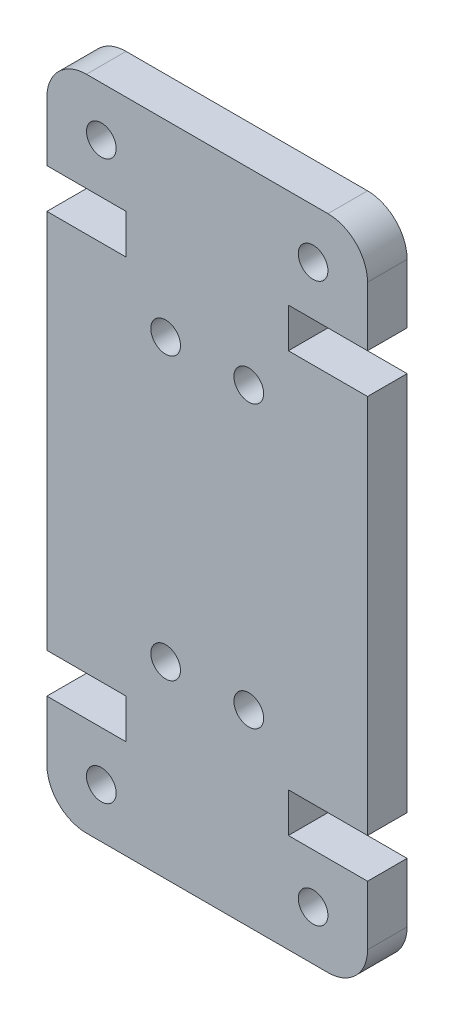
ISO-10303-21;
HEADER;
FILE_DESCRIPTION(('STEP AP214'),'2;1');
FILE_NAME('part.step','',(''),(''),'','','');
FILE_SCHEMA(('AUTOMOTIVE_DESIGN { 1 0 10303 214 1 1 1 1 }'));
ENDSEC;
DATA;
#1=APPLICATION_CONTEXT('core data for automotive mechanical design processes');
#2=APPLICATION_PROTOCOL_DEFINITION('international standard','automotive_design',2000,#1);
#3=PRODUCT_CONTEXT('',#1,'mechanical');
#4=PRODUCT('Part','Part','',(#3));
#5=PRODUCT_RELATED_PRODUCT_CATEGORY('part','',(#4));
#6=PRODUCT_DEFINITION_FORMATION('','',#4);
#7=PRODUCT_DEFINITION_CONTEXT('part definition',#1,'design');
#8=PRODUCT_DEFINITION('design','',#6,#7);
#9=PRODUCT_DEFINITION_SHAPE('','',#8);
#10=(LENGTH_UNIT() NAMED_UNIT(*) SI_UNIT(.MILLI.,.METRE.));
#11=(NAMED_UNIT(*) PLANE_ANGLE_UNIT() SI_UNIT($,.RADIAN.));
#12=(NAMED_UNIT(*) SI_UNIT($,.STERADIAN.) SOLID_ANGLE_UNIT());
#13=UNCERTAINTY_MEASURE_WITH_UNIT(LENGTH_MEASURE(1.E-05),#10,'distance_accuracy_value','');
#14=(GEOMETRIC_REPRESENTATION_CONTEXT(3) GLOBAL_UNCERTAINTY_ASSIGNED_CONTEXT((#13)) GLOBAL_UNIT_ASSIGNED_CONTEXT((#10,
#11,#12)) REPRESENTATION_CONTEXT('',''));
#15=CARTESIAN_POINT('',(0.,0.,0.));
#16=DIRECTION('',(0.,0.,1.));
#17=DIRECTION('',(1.,0.,0.));
#18=AXIS2_PLACEMENT_3D('',#15,#16,#17);
#19=CARTESIAN_POINT('',(2.00000000000001,2.,2.));
#20=DIRECTION('',(0.,0.,1.));
#21=DIRECTION('',(1.,0.,0.));
#22=AXIS2_PLACEMENT_3D('',#19,#20,#21);
#23=PLANE('',#22);
#24=CARTESIAN_POINT('',(10.2,23.7100000000004,2.));
#25=DIRECTION('',(0.,0.,1.));
#26=DIRECTION('',(1.,0.,0.));
#27=AXIS2_PLACEMENT_3D('',#24,#25,#26);
#28=CIRCLE('',#27,0.749999999999999);
#29=CARTESIAN_POINT('',(10.95,23.7100000000004,2.));
#30=VERTEX_POINT('',#29);
#31=EDGE_CURVE('E464',#30,#30,#28,.T.);
#32=ORIENTED_EDGE('',*,*,#31,.F.);
#33=EDGE_LOOP('',(#32));
#34=FACE_BOUND('',#33,.T.);
#35=CARTESIAN_POINT('',(6.,9.49999999999962,2.));
#36=DIRECTION('',(0.,0.,1.));
#37=DIRECTION('',(1.,0.,0.));
#38=AXIS2_PLACEMENT_3D('',#35,#36,#37);
#39=CIRCLE('',#38,0.75);
#40=CARTESIAN_POINT('',(6.75,9.49999999999962,2.));
#41=VERTEX_POINT('',#40);
#42=EDGE_CURVE('E476',#41,#41,#39,.T.);
#43=ORIENTED_EDGE('',*,*,#42,.F.);
#44=EDGE_LOOP('',(#43));
#45=FACE_BOUND('',#44,.T.);
#46=CARTESIAN_POINT('',(2.75000000000003,30.7099999999998,2.));
#47=DIRECTION('',(0.,0.,1.));
#48=DIRECTION('',(-1.,0.,0.));
#49=AXIS2_PLACEMENT_3D('',#46,#47,#48);
#50=CIRCLE('',#49,0.75);
#51=CARTESIAN_POINT('',(2.00000000000003,30.7099999999998,2.));
#52=VERTEX_POINT('',#51);
#53=EDGE_CURVE('E488',#52,#52,#50,.T.);
#54=ORIENTED_EDGE('',*,*,#53,.F.);
#55=EDGE_LOOP('',(#54));
#56=FACE_BOUND('',#55,.T.);
#57=CARTESIAN_POINT('',(13.45,2.50000000000017,2.));
#58=DIRECTION('',(0.,0.,1.));
#59=DIRECTION('',(-1.,0.,0.));
#60=AXIS2_PLACEMENT_3D('',#57,#58,#59);
#61=CIRCLE('',#60,0.750000000000009);
#62=CARTESIAN_POINT('',(12.7,2.50000000000017,2.));
#63=VERTEX_POINT('',#62);
#64=EDGE_CURVE('E230',#63,#63,#61,.T.);
#65=ORIENTED_EDGE('',*,*,#64,.F.);
#66=EDGE_LOOP('',(#65));
#67=FACE_BOUND('',#66,.T.);
#68=DIRECTION('',(1.,0.,0.));
#69=VECTOR('',#68,1.);
#70=CARTESIAN_POINT('',(0.,6.99999999999946,2.));
#71=LINE('',#70,#69);
#72=CARTESIAN_POINT('',(0.,6.99999999999946,2.));
#73=VERTEX_POINT('',#72);
#74=CARTESIAN_POINT('',(4.00000000000001,6.99999999999946,2.));
#75=VERTEX_POINT('',#74);
#76=EDGE_CURVE('E273',#73,#75,#71,.T.);
#77=ORIENTED_EDGE('',*,*,#76,.T.);
#78=DIRECTION('',(0.,-1.,0.));
#79=VECTOR('',#78,1.);
#80=CARTESIAN_POINT('',(4.00000000000001,6.99999999999946,2.));
#81=LINE('',#80,#79);
#82=CARTESIAN_POINT('',(4.,4.99999999999945,2.));
#83=VERTEX_POINT('',#82);
#84=EDGE_CURVE('E141',#75,#83,#81,.T.);
#85=ORIENTED_EDGE('',*,*,#84,.T.);
#86=DIRECTION('',(-1.,0.,0.));
#87=VECTOR('',#86,1.);
#88=CARTESIAN_POINT('',(4.,4.99999999999945,2.));
#89=LINE('',#88,#87);
#90=CARTESIAN_POINT('',(0.,4.99999999999945,2.));
#91=VERTEX_POINT('',#90);
#92=EDGE_CURVE('E336',#83,#91,#89,.T.);
#93=ORIENTED_EDGE('',*,*,#92,.T.);
#94=DIRECTION('',(0.,-1.,0.));
#95=VECTOR('',#94,1.);
#96=CARTESIAN_POINT('',(0.,2.,2.));
#97=LINE('',#96,#95);
#98=CARTESIAN_POINT('',(0.,2.,2.));
#99=VERTEX_POINT('',#98);
#100=EDGE_CURVE('E355',#91,#99,#97,.T.);
#101=ORIENTED_EDGE('',*,*,#100,.T.);
#102=CARTESIAN_POINT('',(2.00000000000001,2.,2.));
#103=DIRECTION('',(0.,0.,1.));
#104=DIRECTION('',(1.,0.,0.));
#105=AXIS2_PLACEMENT_3D('',#102,#103,#104);
#106=CIRCLE('',#105,2.00000000000001);
#107=CARTESIAN_POINT('',(2.00000000000001,0.,2.));
#108=VERTEX_POINT('',#107);
#109=EDGE_CURVE('E352',#99,#108,#106,.T.);
#110=ORIENTED_EDGE('',*,*,#109,.T.);
#111=DIRECTION('',(1.,0.,0.));
#112=VECTOR('',#111,1.);
#113=CARTESIAN_POINT('',(2.00000000000001,0.,2.));
#114=LINE('',#113,#112);
#115=CARTESIAN_POINT('',(14.2,0.,2.));
#116=VERTEX_POINT('',#115);
#117=EDGE_CURVE('E354',#108,#116,#114,.T.);
#118=ORIENTED_EDGE('',*,*,#117,.T.);
#119=CARTESIAN_POINT('',(14.2,2.,2.));
#120=DIRECTION('',(0.,0.,1.));
#121=DIRECTION('',(-1.,0.,0.));
#122=AXIS2_PLACEMENT_3D('',#119,#120,#121);
#123=CIRCLE('',#122,2.);
#124=CARTESIAN_POINT('',(16.2,2.,2.));
#125=VERTEX_POINT('',#124);
#126=EDGE_CURVE('E357',#116,#125,#123,.T.);
#127=ORIENTED_EDGE('',*,*,#126,.T.);
#128=DIRECTION('',(0.,1.,0.));
#129=VECTOR('',#128,1.);
#130=CARTESIAN_POINT('',(16.2,2.,2.));
#131=LINE('',#130,#129);
#132=CARTESIAN_POINT('',(16.2,4.99999999999945,2.));
#133=VERTEX_POINT('',#132);
#134=EDGE_CURVE('E363',#125,#133,#131,.T.);
#135=ORIENTED_EDGE('',*,*,#134,.T.);
#136=DIRECTION('',(-1.,0.,0.));
#137=VECTOR('',#136,1.);
#138=CARTESIAN_POINT('',(12.2,4.99999999999945,2.));
#139=LINE('',#138,#137);
#140=CARTESIAN_POINT('',(12.2,4.99999999999945,2.));
#141=VERTEX_POINT('',#140);
#142=EDGE_CURVE('E365',#133,#141,#139,.T.);
#143=ORIENTED_EDGE('',*,*,#142,.T.);
#144=DIRECTION('',(0.,1.,0.));
#145=VECTOR('',#144,1.);
#146=CARTESIAN_POINT('',(12.2,6.99999999999945,2.));
#147=LINE('',#146,#145);
#148=CARTESIAN_POINT('',(12.2,6.99999999999945,2.));
#149=VERTEX_POINT('',#148);
#150=EDGE_CURVE('E367',#141,#149,#147,.T.);
#151=ORIENTED_EDGE('',*,*,#150,.T.);
#152=DIRECTION('',(1.,0.,0.));
#153=VECTOR('',#152,1.);
#154=CARTESIAN_POINT('',(16.2,6.99999999999945,2.));
#155=LINE('',#154,#153);
#156=CARTESIAN_POINT('',(16.2,6.99999999999945,2.));
#157=VERTEX_POINT('',#156);
#158=EDGE_CURVE('E369',#149,#157,#155,.T.);
#159=ORIENTED_EDGE('',*,*,#158,.T.);
#160=DIRECTION('',(0.,1.,0.));
#161=VECTOR('',#160,1.);
#162=CARTESIAN_POINT('',(16.2,26.2100000000006,2.));
#163=LINE('',#162,#161);
#164=CARTESIAN_POINT('',(16.2,26.2100000000006,2.));
#165=VERTEX_POINT('',#164);
#166=EDGE_CURVE('E371',#157,#165,#163,.T.);
#167=ORIENTED_EDGE('',*,*,#166,.T.);
#168=DIRECTION('',(-1.,0.,0.));
#169=VECTOR('',#168,1.);
#170=CARTESIAN_POINT('',(16.2,26.2100000000006,2.));
#171=LINE('',#170,#169);
#172=CARTESIAN_POINT('',(12.2,26.2100000000006,2.));
#173=VERTEX_POINT('',#172);
#174=EDGE_CURVE('E373',#165,#173,#171,.T.);
#175=ORIENTED_EDGE('',*,*,#174,.T.);
#176=DIRECTION('',(0.,1.,0.));
#177=VECTOR('',#176,1.);
#178=CARTESIAN_POINT('',(12.2,26.2100000000006,2.));
#179=LINE('',#178,#177);
#180=CARTESIAN_POINT('',(12.2,28.2100000000006,2.));
#181=VERTEX_POINT('',#180);
#182=EDGE_CURVE('E375',#173,#181,#179,.T.);
#183=ORIENTED_EDGE('',*,*,#182,.T.);
#184=DIRECTION('',(1.,0.,0.));
#185=VECTOR('',#184,1.);
#186=CARTESIAN_POINT('',(12.2,28.2100000000006,2.));
#187=LINE('',#186,#185);
#188=CARTESIAN_POINT('',(16.2,28.2100000000006,2.));
#189=VERTEX_POINT('',#188);
#190=EDGE_CURVE('E377',#181,#189,#187,.T.);
#191=ORIENTED_EDGE('',*,*,#190,.T.);
#192=DIRECTION('',(0.,1.,0.));
#193=VECTOR('',#192,1.);
#194=CARTESIAN_POINT('',(16.2,31.21,2.));
#195=LINE('',#194,#193);
#196=CARTESIAN_POINT('',(16.2,31.21,2.));
#197=VERTEX_POINT('',#196);
#198=EDGE_CURVE('E379',#189,#197,#195,.T.);
#199=ORIENTED_EDGE('',*,*,#198,.T.);
#200=CARTESIAN_POINT('',(14.2,31.21,2.));
#201=DIRECTION('',(0.,0.,1.));
#202=DIRECTION('',(1.,0.,0.));
#203=AXIS2_PLACEMENT_3D('',#200,#201,#202);
#204=CIRCLE('',#203,2.);
#205=CARTESIAN_POINT('',(14.2,33.21,2.));
#206=VERTEX_POINT('',#205);
#207=EDGE_CURVE('E381',#197,#206,#204,.T.);
#208=ORIENTED_EDGE('',*,*,#207,.T.);
#209=DIRECTION('',(-1.,0.,0.));
#210=VECTOR('',#209,1.);
#211=CARTESIAN_POINT('',(1.99999999999999,33.21,2.));
#212=LINE('',#211,#210);
#213=CARTESIAN_POINT('',(1.99999999999999,33.21,2.));
#214=VERTEX_POINT('',#213);
#215=EDGE_CURVE('E383',#206,#214,#212,.T.);
#216=ORIENTED_EDGE('',*,*,#215,.T.);
#217=CARTESIAN_POINT('',(1.99999999999999,31.21,2.));
#218=DIRECTION('',(0.,0.,1.));
#219=DIRECTION('',(-1.,0.,0.));
#220=AXIS2_PLACEMENT_3D('',#217,#218,#219);
#221=CIRCLE('',#220,2.);
#222=CARTESIAN_POINT('',(0.,31.21,2.));
#223=VERTEX_POINT('',#222);
#224=EDGE_CURVE('E385',#214,#223,#221,.T.);
#225=ORIENTED_EDGE('',*,*,#224,.T.);
#226=DIRECTION('',(0.,-1.,0.));
#227=VECTOR('',#226,1.);
#228=CARTESIAN_POINT('',(0.,31.21,2.));
#229=LINE('',#228,#227);
#230=CARTESIAN_POINT('',(0.,28.2100000000006,2.));
#231=VERTEX_POINT('',#230);
#232=EDGE_CURVE('E387',#223,#231,#229,.T.);
#233=ORIENTED_EDGE('',*,*,#232,.T.);
#234=DIRECTION('',(1.,0.,0.));
#235=VECTOR('',#234,1.);
#236=CARTESIAN_POINT('',(3.99999999999999,28.2100000000006,2.));
#237=LINE('',#236,#235);
#238=CARTESIAN_POINT('',(3.99999999999999,28.2100000000006,2.));
#239=VERTEX_POINT('',#238);
#240=EDGE_CURVE('E208',#231,#239,#237,.T.);
#241=ORIENTED_EDGE('',*,*,#240,.T.);
#242=DIRECTION('',(0.,-1.,0.));
#243=VECTOR('',#242,1.);
#244=CARTESIAN_POINT('',(3.99999999999999,26.2100000000006,2.));
#245=LINE('',#244,#243);
#246=CARTESIAN_POINT('',(3.99999999999999,26.2100000000006,2.));
#247=VERTEX_POINT('',#246);
#248=EDGE_CURVE('E202',#239,#247,#245,.T.);
#249=ORIENTED_EDGE('',*,*,#248,.T.);
#250=DIRECTION('',(-1.,0.,0.));
#251=VECTOR('',#250,1.);
#252=CARTESIAN_POINT('',(0.,26.2100000000005,2.));
#253=LINE('',#252,#251);
#254=CARTESIAN_POINT('',(0.,26.2100000000005,2.));
#255=VERTEX_POINT('',#254);
#256=EDGE_CURVE('E206',#247,#255,#253,.T.);
#257=ORIENTED_EDGE('',*,*,#256,.T.);
#258=DIRECTION('',(0.,-1.,0.));
#259=VECTOR('',#258,1.);
#260=CARTESIAN_POINT('',(0.,26.2100000000005,2.));
#261=LINE('',#260,#259);
#262=EDGE_CURVE('E50',#255,#73,#261,.T.);
#263=ORIENTED_EDGE('',*,*,#262,.T.);
#264=EDGE_LOOP('',(#77,#85,#93,#101,#110,#118,#127,#135,#143,#151,#159,#167,#175,#183,#191,#199,
#208,#216,#225,#233,#241,#249,#257,#263));
#265=FACE_BOUND('',#264,.T.);
#266=CARTESIAN_POINT('',(10.2,9.49999999999962,2.));
#267=DIRECTION('',(0.,0.,1.));
#268=DIRECTION('',(-1.,0.,0.));
#269=AXIS2_PLACEMENT_3D('',#266,#267,#268);
#270=CIRCLE('',#269,0.750000000000002);
#271=CARTESIAN_POINT('',(9.45,9.49999999999962,2.));
#272=VERTEX_POINT('',#271);
#273=EDGE_CURVE('E494',#272,#272,#270,.T.);
#274=ORIENTED_EDGE('',*,*,#273,.F.);
#275=EDGE_LOOP('',(#274));
#276=FACE_BOUND('',#275,.T.);
#277=CARTESIAN_POINT('',(5.99999999999999,23.7100000000004,2.));
#278=DIRECTION('',(0.,0.,1.));
#279=DIRECTION('',(-1.,0.,0.));
#280=AXIS2_PLACEMENT_3D('',#277,#278,#279);
#281=CIRCLE('',#280,0.750000000000001);
#282=CARTESIAN_POINT('',(5.24999999999999,23.7100000000004,2.));
#283=VERTEX_POINT('',#282);
#284=EDGE_CURVE('E482',#283,#283,#281,.T.);
#285=ORIENTED_EDGE('',*,*,#284,.F.);
#286=EDGE_LOOP('',(#285));
#287=FACE_BOUND('',#286,.T.);
#288=CARTESIAN_POINT('',(2.75000000000004,2.50000000000017,2.));
#289=DIRECTION('',(0.,0.,1.));
#290=DIRECTION('',(1.,0.,0.));
#291=AXIS2_PLACEMENT_3D('',#288,#289,#290);
#292=CIRCLE('',#291,0.75);
#293=CARTESIAN_POINT('',(3.50000000000004,2.50000000000017,2.));
#294=VERTEX_POINT('',#293);
#295=EDGE_CURVE('E470',#294,#294,#292,.T.);
#296=ORIENTED_EDGE('',*,*,#295,.F.);
#297=EDGE_LOOP('',(#296));
#298=FACE_BOUND('',#297,.T.);
#299=CARTESIAN_POINT('',(13.45,30.7099999999998,2.));
#300=DIRECTION('',(0.,0.,1.));
#301=DIRECTION('',(1.,0.,0.));
#302=AXIS2_PLACEMENT_3D('',#299,#300,#301);
#303=CIRCLE('',#302,0.75000000000001);
#304=CARTESIAN_POINT('',(14.2,30.7099999999998,2.));
#305=VERTEX_POINT('',#304);
#306=EDGE_CURVE('E455',#305,#305,#303,.T.);
#307=ORIENTED_EDGE('',*,*,#306,.F.);
#308=EDGE_LOOP('',(#307));
#309=FACE_BOUND('',#308,.T.);
#310=ADVANCED_FACE('F33',(#34,#45,#56,#67,#265,#276,#287,#298,#309),#23,.T.);
#311=CARTESIAN_POINT('',(2.00000000000001,2.,0.));
#312=DIRECTION('',(0.,0.,1.));
#313=DIRECTION('',(1.,0.,0.));
#314=AXIS2_PLACEMENT_3D('',#311,#312,#313);
#315=PLANE('',#314);
#316=CARTESIAN_POINT('',(10.2,23.7100000000004,0.));
#317=DIRECTION('',(0.,0.,1.));
#318=DIRECTION('',(1.,0.,0.));
#319=AXIS2_PLACEMENT_3D('',#316,#317,#318);
#320=CIRCLE('',#319,0.749999999999999);
#321=CARTESIAN_POINT('',(10.95,23.7100000000004,0.));
#322=VERTEX_POINT('',#321);
#323=EDGE_CURVE('E461',#322,#322,#320,.T.);
#324=ORIENTED_EDGE('',*,*,#323,.T.);
#325=EDGE_LOOP('',(#324));
#326=FACE_BOUND('',#325,.T.);
#327=CARTESIAN_POINT('',(6.,9.49999999999962,0.));
#328=DIRECTION('',(0.,0.,1.));
#329=DIRECTION('',(1.,0.,0.));
#330=AXIS2_PLACEMENT_3D('',#327,#328,#329);
#331=CIRCLE('',#330,0.75);
#332=CARTESIAN_POINT('',(6.75,9.49999999999962,0.));
#333=VERTEX_POINT('',#332);
#334=EDGE_CURVE('E473',#333,#333,#331,.T.);
#335=ORIENTED_EDGE('',*,*,#334,.T.);
#336=EDGE_LOOP('',(#335));
#337=FACE_BOUND('',#336,.T.);
#338=CARTESIAN_POINT('',(2.75000000000003,30.7099999999998,0.));
#339=DIRECTION('',(0.,0.,1.));
#340=DIRECTION('',(-1.,0.,0.));
#341=AXIS2_PLACEMENT_3D('',#338,#339,#340);
#342=CIRCLE('',#341,0.75);
#343=CARTESIAN_POINT('',(2.00000000000003,30.7099999999998,0.));
#344=VERTEX_POINT('',#343);
#345=EDGE_CURVE('E485',#344,#344,#342,.T.);
#346=ORIENTED_EDGE('',*,*,#345,.T.);
#347=EDGE_LOOP('',(#346));
#348=FACE_BOUND('',#347,.T.);
#349=CARTESIAN_POINT('',(13.45,2.50000000000017,0.));
#350=DIRECTION('',(0.,0.,1.));
#351=DIRECTION('',(-1.,0.,0.));
#352=AXIS2_PLACEMENT_3D('',#349,#350,#351);
#353=CIRCLE('',#352,0.750000000000009);
#354=CARTESIAN_POINT('',(12.7,2.50000000000017,0.));
#355=VERTEX_POINT('',#354);
#356=EDGE_CURVE('E497',#355,#355,#353,.T.);
#357=ORIENTED_EDGE('',*,*,#356,.T.);
#358=EDGE_LOOP('',(#357));
#359=FACE_BOUND('',#358,.T.);
#360=DIRECTION('',(1.,0.,0.));
#361=VECTOR('',#360,1.);
#362=CARTESIAN_POINT('',(0.,6.99999999999946,0.));
#363=LINE('',#362,#361);
#364=CARTESIAN_POINT('',(0.,6.99999999999946,0.));
#365=VERTEX_POINT('',#364);
#366=CARTESIAN_POINT('',(4.00000000000001,6.99999999999946,0.));
#367=VERTEX_POINT('',#366);
#368=EDGE_CURVE('E226',#365,#367,#363,.T.);
#369=ORIENTED_EDGE('',*,*,#368,.F.);
#370=DIRECTION('',(0.,-1.,0.));
#371=VECTOR('',#370,1.);
#372=CARTESIAN_POINT('',(0.,26.2100000000005,0.));
#373=LINE('',#372,#371);
#374=CARTESIAN_POINT('',(0.,26.2100000000005,0.));
#375=VERTEX_POINT('',#374);
#376=EDGE_CURVE('E133',#375,#365,#373,.T.);
#377=ORIENTED_EDGE('',*,*,#376,.F.);
#378=DIRECTION('',(-1.,0.,0.));
#379=VECTOR('',#378,1.);
#380=CARTESIAN_POINT('',(0.,26.2100000000005,0.));
#381=LINE('',#380,#379);
#382=CARTESIAN_POINT('',(3.99999999999999,26.2100000000006,0.));
#383=VERTEX_POINT('',#382);
#384=EDGE_CURVE('E127',#383,#375,#381,.T.);
#385=ORIENTED_EDGE('',*,*,#384,.F.);
#386=DIRECTION('',(0.,-1.,0.));
#387=VECTOR('',#386,1.);
#388=CARTESIAN_POINT('',(3.99999999999999,26.2100000000006,0.));
#389=LINE('',#388,#387);
#390=CARTESIAN_POINT('',(3.99999999999999,28.2100000000006,0.));
#391=VERTEX_POINT('',#390);
#392=EDGE_CURVE('E216',#391,#383,#389,.T.);
#393=ORIENTED_EDGE('',*,*,#392,.F.);
#394=DIRECTION('',(1.,0.,0.));
#395=VECTOR('',#394,1.);
#396=CARTESIAN_POINT('',(3.99999999999999,28.2100000000006,0.));
#397=LINE('',#396,#395);
#398=CARTESIAN_POINT('',(0.,28.2100000000006,0.));
#399=VERTEX_POINT('',#398);
#400=EDGE_CURVE('E268',#399,#391,#397,.T.);
#401=ORIENTED_EDGE('',*,*,#400,.F.);
#402=DIRECTION('',(0.,-1.,0.));
#403=VECTOR('',#402,1.);
#404=CARTESIAN_POINT('',(0.,31.21,0.));
#405=LINE('',#404,#403);
#406=CARTESIAN_POINT('',(0.,31.21,0.));
#407=VERTEX_POINT('',#406);
#408=EDGE_CURVE('E266',#407,#399,#405,.T.);
#409=ORIENTED_EDGE('',*,*,#408,.F.);
#410=CARTESIAN_POINT('',(1.99999999999999,31.21,0.));
#411=DIRECTION('',(0.,0.,1.));
#412=DIRECTION('',(-1.,0.,0.));
#413=AXIS2_PLACEMENT_3D('',#410,#411,#412);
#414=CIRCLE('',#413,2.);
#415=CARTESIAN_POINT('',(1.99999999999999,33.21,0.));
#416=VERTEX_POINT('',#415);
#417=EDGE_CURVE('E264',#416,#407,#414,.T.);
#418=ORIENTED_EDGE('',*,*,#417,.F.);
#419=DIRECTION('',(-1.,0.,0.));
#420=VECTOR('',#419,1.);
#421=CARTESIAN_POINT('',(1.99999999999999,33.21,0.));
#422=LINE('',#421,#420);
#423=CARTESIAN_POINT('',(14.2,33.21,0.));
#424=VERTEX_POINT('',#423);
#425=EDGE_CURVE('E262',#424,#416,#422,.T.);
#426=ORIENTED_EDGE('',*,*,#425,.F.);
#427=CARTESIAN_POINT('',(14.2,31.21,0.));
#428=DIRECTION('',(0.,0.,1.));
#429=DIRECTION('',(1.,0.,0.));
#430=AXIS2_PLACEMENT_3D('',#427,#428,#429);
#431=CIRCLE('',#430,2.);
#432=CARTESIAN_POINT('',(16.2,31.21,0.));
#433=VERTEX_POINT('',#432);
#434=EDGE_CURVE('E260',#433,#424,#431,.T.);
#435=ORIENTED_EDGE('',*,*,#434,.F.);
#436=DIRECTION('',(0.,1.,0.));
#437=VECTOR('',#436,1.);
#438=CARTESIAN_POINT('',(16.2,31.21,0.));
#439=LINE('',#438,#437);
#440=CARTESIAN_POINT('',(16.2,28.2100000000006,0.));
#441=VERTEX_POINT('',#440);
#442=EDGE_CURVE('E258',#441,#433,#439,.T.);
#443=ORIENTED_EDGE('',*,*,#442,.F.);
#444=DIRECTION('',(1.,0.,0.));
#445=VECTOR('',#444,1.);
#446=CARTESIAN_POINT('',(12.2,28.2100000000006,0.));
#447=LINE('',#446,#445);
#448=CARTESIAN_POINT('',(12.2,28.2100000000006,0.));
#449=VERTEX_POINT('',#448);
#450=EDGE_CURVE('E256',#449,#441,#447,.T.);
#451=ORIENTED_EDGE('',*,*,#450,.F.);
#452=DIRECTION('',(0.,1.,0.));
#453=VECTOR('',#452,1.);
#454=CARTESIAN_POINT('',(12.2,26.2100000000006,0.));
#455=LINE('',#454,#453);
#456=CARTESIAN_POINT('',(12.2,26.2100000000006,0.));
#457=VERTEX_POINT('',#456);
#458=EDGE_CURVE('E254',#457,#449,#455,.T.);
#459=ORIENTED_EDGE('',*,*,#458,.F.);
#460=DIRECTION('',(-1.,0.,0.));
#461=VECTOR('',#460,1.);
#462=CARTESIAN_POINT('',(16.2,26.2100000000006,0.));
#463=LINE('',#462,#461);
#464=CARTESIAN_POINT('',(16.2,26.2100000000006,0.));
#465=VERTEX_POINT('',#464);
#466=EDGE_CURVE('E252',#465,#457,#463,.T.);
#467=ORIENTED_EDGE('',*,*,#466,.F.);
#468=DIRECTION('',(0.,1.,0.));
#469=VECTOR('',#468,1.);
#470=CARTESIAN_POINT('',(16.2,26.2100000000006,0.));
#471=LINE('',#470,#469);
#472=CARTESIAN_POINT('',(16.2,6.99999999999945,0.));
#473=VERTEX_POINT('',#472);
#474=EDGE_CURVE('E250',#473,#465,#471,.T.);
#475=ORIENTED_EDGE('',*,*,#474,.F.);
#476=DIRECTION('',(1.,0.,0.));
#477=VECTOR('',#476,1.);
#478=CARTESIAN_POINT('',(16.2,6.99999999999945,0.));
#479=LINE('',#478,#477);
#480=CARTESIAN_POINT('',(12.2,6.99999999999945,0.));
#481=VERTEX_POINT('',#480);
#482=EDGE_CURVE('E248',#481,#473,#479,.T.);
#483=ORIENTED_EDGE('',*,*,#482,.F.);
#484=DIRECTION('',(0.,1.,0.));
#485=VECTOR('',#484,1.);
#486=CARTESIAN_POINT('',(12.2,6.99999999999945,0.));
#487=LINE('',#486,#485);
#488=CARTESIAN_POINT('',(12.2,4.99999999999945,0.));
#489=VERTEX_POINT('',#488);
#490=EDGE_CURVE('E246',#489,#481,#487,.T.);
#491=ORIENTED_EDGE('',*,*,#490,.F.);
#492=DIRECTION('',(-1.,0.,0.));
#493=VECTOR('',#492,1.);
#494=CARTESIAN_POINT('',(12.2,4.99999999999945,0.));
#495=LINE('',#494,#493);
#496=CARTESIAN_POINT('',(16.2,4.99999999999945,0.));
#497=VERTEX_POINT('',#496);
#498=EDGE_CURVE('E244',#497,#489,#495,.T.);
#499=ORIENTED_EDGE('',*,*,#498,.F.);
#500=DIRECTION('',(0.,1.,0.));
#501=VECTOR('',#500,1.);
#502=CARTESIAN_POINT('',(16.2,2.,0.));
#503=LINE('',#502,#501);
#504=CARTESIAN_POINT('',(16.2,2.,0.));
#505=VERTEX_POINT('',#504);
#506=EDGE_CURVE('E242',#505,#497,#503,.T.);
#507=ORIENTED_EDGE('',*,*,#506,.F.);
#508=CARTESIAN_POINT('',(14.2,2.,0.));
#509=DIRECTION('',(0.,0.,1.));
#510=DIRECTION('',(-1.,0.,0.));
#511=AXIS2_PLACEMENT_3D('',#508,#509,#510);
#512=CIRCLE('',#511,2.);
#513=CARTESIAN_POINT('',(14.2,0.,0.));
#514=VERTEX_POINT('',#513);
#515=EDGE_CURVE('E240',#514,#505,#512,.T.);
#516=ORIENTED_EDGE('',*,*,#515,.F.);
#517=DIRECTION('',(1.,0.,0.));
#518=VECTOR('',#517,1.);
#519=CARTESIAN_POINT('',(2.00000000000001,0.,0.));
#520=LINE('',#519,#518);
#521=CARTESIAN_POINT('',(2.00000000000001,0.,0.));
#522=VERTEX_POINT('',#521);
#523=EDGE_CURVE('E238',#522,#514,#520,.T.);
#524=ORIENTED_EDGE('',*,*,#523,.F.);
#525=CARTESIAN_POINT('',(2.00000000000001,2.,0.));
#526=DIRECTION('',(0.,0.,1.));
#527=DIRECTION('',(1.,0.,0.));
#528=AXIS2_PLACEMENT_3D('',#525,#526,#527);
#529=CIRCLE('',#528,2.00000000000001);
#530=CARTESIAN_POINT('',(0.,2.,0.));
#531=VERTEX_POINT('',#530);
#532=EDGE_CURVE('E236',#531,#522,#529,.T.);
#533=ORIENTED_EDGE('',*,*,#532,.F.);
#534=DIRECTION('',(0.,-1.,0.));
#535=VECTOR('',#534,1.);
#536=CARTESIAN_POINT('',(0.,2.,0.));
#537=LINE('',#536,#535);
#538=CARTESIAN_POINT('',(0.,4.99999999999945,0.));
#539=VERTEX_POINT('',#538);
#540=EDGE_CURVE('E234',#539,#531,#537,.T.);
#541=ORIENTED_EDGE('',*,*,#540,.F.);
#542=DIRECTION('',(-1.,0.,0.));
#543=VECTOR('',#542,1.);
#544=CARTESIAN_POINT('',(4.,4.99999999999945,0.));
#545=LINE('',#544,#543);
#546=CARTESIAN_POINT('',(4.,4.99999999999945,0.));
#547=VERTEX_POINT('',#546);
#548=EDGE_CURVE('E232',#547,#539,#545,.T.);
#549=ORIENTED_EDGE('',*,*,#548,.F.);
#550=DIRECTION('',(0.,-1.,0.));
#551=VECTOR('',#550,1.);
#552=CARTESIAN_POINT('',(4.00000000000001,6.99999999999946,0.));
#553=LINE('',#552,#551);
#554=EDGE_CURVE('E229',#367,#547,#553,.T.);
#555=ORIENTED_EDGE('',*,*,#554,.F.);
#556=EDGE_LOOP('',(#369,#377,#385,#393,#401,#409,#418,#426,#435,#443,#451,#459,#467,#475,#483,
#491,#499,#507,#516,#524,#533,#541,#549,#555));
#557=FACE_BOUND('',#556,.T.);
#558=CARTESIAN_POINT('',(10.2,9.49999999999962,0.));
#559=DIRECTION('',(0.,0.,1.));
#560=DIRECTION('',(-1.,0.,0.));
#561=AXIS2_PLACEMENT_3D('',#558,#559,#560);
#562=CIRCLE('',#561,0.750000000000002);
#563=CARTESIAN_POINT('',(9.45,9.49999999999962,0.));
#564=VERTEX_POINT('',#563);
#565=EDGE_CURVE('E491',#564,#564,#562,.T.);
#566=ORIENTED_EDGE('',*,*,#565,.T.);
#567=EDGE_LOOP('',(#566));
#568=FACE_BOUND('',#567,.T.);
#569=CARTESIAN_POINT('',(5.99999999999999,23.7100000000004,0.));
#570=DIRECTION('',(0.,0.,1.));
#571=DIRECTION('',(-1.,0.,0.));
#572=AXIS2_PLACEMENT_3D('',#569,#570,#571);
#573=CIRCLE('',#572,0.750000000000001);
#574=CARTESIAN_POINT('',(5.24999999999999,23.7100000000004,0.));
#575=VERTEX_POINT('',#574);
#576=EDGE_CURVE('E479',#575,#575,#573,.T.);
#577=ORIENTED_EDGE('',*,*,#576,.T.);
#578=EDGE_LOOP('',(#577));
#579=FACE_BOUND('',#578,.T.);
#580=CARTESIAN_POINT('',(2.75000000000004,2.50000000000017,0.));
#581=DIRECTION('',(0.,0.,1.));
#582=DIRECTION('',(1.,0.,0.));
#583=AXIS2_PLACEMENT_3D('',#580,#581,#582);
#584=CIRCLE('',#583,0.75);
#585=CARTESIAN_POINT('',(3.50000000000004,2.50000000000017,0.));
#586=VERTEX_POINT('',#585);
#587=EDGE_CURVE('E467',#586,#586,#584,.T.);
#588=ORIENTED_EDGE('',*,*,#587,.T.);
#589=EDGE_LOOP('',(#588));
#590=FACE_BOUND('',#589,.T.);
#591=CARTESIAN_POINT('',(13.45,30.7099999999998,0.));
#592=DIRECTION('',(0.,0.,1.));
#593=DIRECTION('',(1.,0.,0.));
#594=AXIS2_PLACEMENT_3D('',#591,#592,#593);
#595=CIRCLE('',#594,0.75000000000001);
#596=CARTESIAN_POINT('',(14.2,30.7099999999998,0.));
#597=VERTEX_POINT('',#596);
#598=EDGE_CURVE('E458',#597,#597,#595,.T.);
#599=ORIENTED_EDGE('',*,*,#598,.T.);
#600=EDGE_LOOP('',(#599));
#601=FACE_BOUND('',#600,.T.);
#602=ADVANCED_FACE('F340',(#326,#337,#348,#359,#557,#568,#579,#590,#601),#315,.F.);
#603=CARTESIAN_POINT('',(0.,6.99999999999946,2.));
#604=DIRECTION('',(0.,1.,0.));
#605=DIRECTION('',(0.,0.,1.));
#606=AXIS2_PLACEMENT_3D('',#603,#604,#605);
#607=PLANE('',#606);
#608=ORIENTED_EDGE('',*,*,#368,.T.);
#609=DIRECTION('',(0.,0.,-1.));
#610=VECTOR('',#609,1.);
#611=CARTESIAN_POINT('',(4.00000000000001,6.99999999999946,2.));
#612=LINE('',#611,#610);
#613=EDGE_CURVE('E11',#75,#367,#612,.T.);
#614=ORIENTED_EDGE('',*,*,#613,.F.);
#615=ORIENTED_EDGE('',*,*,#76,.F.);
#616=DIRECTION('',(0.,0.,-1.));
#617=VECTOR('',#616,1.);
#618=CARTESIAN_POINT('',(0.,6.99999999999946,2.));
#619=LINE('',#618,#617);
#620=EDGE_CURVE('E222',#73,#365,#619,.T.);
#621=ORIENTED_EDGE('',*,*,#620,.T.);
#622=EDGE_LOOP('',(#608,#614,#615,#621));
#623=FACE_BOUND('',#622,.T.);
#624=ADVANCED_FACE('F35',(#623),#607,.F.);
#625=CARTESIAN_POINT('',(4.00000000000001,6.99999999999946,2.));
#626=DIRECTION('',(1.,0.,0.));
#627=DIRECTION('',(0.,1.,0.));
#628=AXIS2_PLACEMENT_3D('',#625,#626,#627);
#629=PLANE('',#628);
#630=ORIENTED_EDGE('',*,*,#554,.T.);
#631=DIRECTION('',(0.,0.,-1.));
#632=VECTOR('',#631,1.);
#633=CARTESIAN_POINT('',(4.,4.99999999999945,2.));
#634=LINE('',#633,#632);
#635=EDGE_CURVE('E42',#83,#547,#634,.T.);
#636=ORIENTED_EDGE('',*,*,#635,.F.);
#637=ORIENTED_EDGE('',*,*,#84,.F.);
#638=ORIENTED_EDGE('',*,*,#613,.T.);
#639=EDGE_LOOP('',(#630,#636,#637,#638));
#640=FACE_BOUND('',#639,.T.);
#641=ADVANCED_FACE('F762',(#640),#629,.F.);
#642=CARTESIAN_POINT('',(4.,4.99999999999945,2.));
#643=DIRECTION('',(0.,-1.,0.));
#644=DIRECTION('',(0.,0.,-1.));
#645=AXIS2_PLACEMENT_3D('',#642,#643,#644);
#646=PLANE('',#645);
#647=ORIENTED_EDGE('',*,*,#548,.T.);
#648=DIRECTION('',(0.,0.,-1.));
#649=VECTOR('',#648,1.);
#650=CARTESIAN_POINT('',(0.,4.99999999999945,2.));
#651=LINE('',#650,#649);
#652=EDGE_CURVE('E328',#91,#539,#651,.T.);
#653=ORIENTED_EDGE('',*,*,#652,.F.);
#654=ORIENTED_EDGE('',*,*,#92,.F.);
#655=ORIENTED_EDGE('',*,*,#635,.T.);
#656=EDGE_LOOP('',(#647,#653,#654,#655));
#657=FACE_BOUND('',#656,.T.);
#658=ADVANCED_FACE('F334',(#657),#646,.F.);
#659=CARTESIAN_POINT('',(0.,2.,2.));
#660=DIRECTION('',(1.,0.,0.));
#661=DIRECTION('',(0.,0.,-1.));
#662=AXIS2_PLACEMENT_3D('',#659,#660,#661);
#663=PLANE('',#662);
#664=ORIENTED_EDGE('',*,*,#540,.T.);
#665=DIRECTION('',(0.,0.,-1.));
#666=VECTOR('',#665,1.);
#667=CARTESIAN_POINT('',(0.,2.,2.));
#668=LINE('',#667,#666);
#669=EDGE_CURVE('E325',#99,#531,#668,.T.);
#670=ORIENTED_EDGE('',*,*,#669,.F.);
#671=ORIENTED_EDGE('',*,*,#100,.F.);
#672=ORIENTED_EDGE('',*,*,#652,.T.);
#673=EDGE_LOOP('',(#664,#670,#671,#672));
#674=FACE_BOUND('',#673,.T.);
#675=ADVANCED_FACE('F346',(#674),#663,.F.);
#676=CARTESIAN_POINT('',(2.00000000000001,2.,2.));
#677=DIRECTION('',(0.,0.,-1.));
#678=DIRECTION('',(-1.,0.,0.));
#679=AXIS2_PLACEMENT_3D('',#676,#677,#678);
#680=CYLINDRICAL_SURFACE('',#679,2.00000000000001);
#681=ORIENTED_EDGE('',*,*,#532,.T.);
#682=DIRECTION('',(0.,0.,-1.));
#683=VECTOR('',#682,1.);
#684=CARTESIAN_POINT('',(2.00000000000001,0.,2.));
#685=LINE('',#684,#683);
#686=EDGE_CURVE('E322',#108,#522,#685,.T.);
#687=ORIENTED_EDGE('',*,*,#686,.F.);
#688=ORIENTED_EDGE('',*,*,#109,.F.);
#689=ORIENTED_EDGE('',*,*,#669,.T.);
#690=EDGE_LOOP('',(#681,#687,#688,#689));
#691=FACE_BOUND('',#690,.T.);
#692=ADVANCED_FACE('F350',(#691),#680,.T.);
#693=CARTESIAN_POINT('',(2.00000000000001,0.,2.));
#694=DIRECTION('',(0.,1.,0.));
#695=DIRECTION('',(-1.,0.,0.));
#696=AXIS2_PLACEMENT_3D('',#693,#694,#695);
#697=PLANE('',#696);
#698=ORIENTED_EDGE('',*,*,#523,.T.);
#699=DIRECTION('',(0.,0.,-1.));
#700=VECTOR('',#699,1.);
#701=CARTESIAN_POINT('',(14.2,0.,2.));
#702=LINE('',#701,#700);
#703=EDGE_CURVE('E319',#116,#514,#702,.T.);
#704=ORIENTED_EDGE('',*,*,#703,.F.);
#705=ORIENTED_EDGE('',*,*,#117,.F.);
#706=ORIENTED_EDGE('',*,*,#686,.T.);
#707=EDGE_LOOP('',(#698,#704,#705,#706));
#708=FACE_BOUND('',#707,.T.);
#709=ADVANCED_FACE('F727',(#708),#697,.F.);
#710=CARTESIAN_POINT('',(14.2,2.,2.));
#711=DIRECTION('',(0.,0.,-1.));
#712=DIRECTION('',(-1.,0.,0.));
#713=AXIS2_PLACEMENT_3D('',#710,#711,#712);
#714=CYLINDRICAL_SURFACE('',#713,2.);
#715=ORIENTED_EDGE('',*,*,#515,.T.);
#716=DIRECTION('',(0.,0.,-1.));
#717=VECTOR('',#716,1.);
#718=CARTESIAN_POINT('',(16.2,2.,2.));
#719=LINE('',#718,#717);
#720=EDGE_CURVE('E316',#125,#505,#719,.T.);
#721=ORIENTED_EDGE('',*,*,#720,.F.);
#722=ORIENTED_EDGE('',*,*,#126,.F.);
#723=ORIENTED_EDGE('',*,*,#703,.T.);
#724=EDGE_LOOP('',(#715,#721,#722,#723));
#725=FACE_BOUND('',#724,.T.);
#726=ADVANCED_FACE('F717',(#725),#714,.T.);
#727=CARTESIAN_POINT('',(16.2,2.,2.));
#728=DIRECTION('',(-1.,0.,0.));
#729=DIRECTION('',(0.,0.,1.));
#730=AXIS2_PLACEMENT_3D('',#727,#728,#729);
#731=PLANE('',#730);
#732=ORIENTED_EDGE('',*,*,#506,.T.);
#733=DIRECTION('',(0.,0.,-1.));
#734=VECTOR('',#733,1.);
#735=CARTESIAN_POINT('',(16.2,4.99999999999945,2.));
#736=LINE('',#735,#734);
#737=EDGE_CURVE('E313',#133,#497,#736,.T.);
#738=ORIENTED_EDGE('',*,*,#737,.F.);
#739=ORIENTED_EDGE('',*,*,#134,.F.);
#740=ORIENTED_EDGE('',*,*,#720,.T.);
#741=EDGE_LOOP('',(#732,#738,#739,#740));
#742=FACE_BOUND('',#741,.T.);
#743=ADVANCED_FACE('F707',(#742),#731,.F.);
#744=CARTESIAN_POINT('',(12.2,4.99999999999945,2.));
#745=DIRECTION('',(0.,-1.,0.));
#746=DIRECTION('',(0.,0.,-1.));
#747=AXIS2_PLACEMENT_3D('',#744,#745,#746);
#748=PLANE('',#747);
#749=ORIENTED_EDGE('',*,*,#498,.T.);
#750=DIRECTION('',(0.,0.,-1.));
#751=VECTOR('',#750,1.);
#752=CARTESIAN_POINT('',(12.2,4.99999999999945,2.));
#753=LINE('',#752,#751);
#754=EDGE_CURVE('E310',#141,#489,#753,.T.);
#755=ORIENTED_EDGE('',*,*,#754,.F.);
#756=ORIENTED_EDGE('',*,*,#142,.F.);
#757=ORIENTED_EDGE('',*,*,#737,.T.);
#758=EDGE_LOOP('',(#749,#755,#756,#757));
#759=FACE_BOUND('',#758,.T.);
#760=ADVANCED_FACE('F697',(#759),#748,.F.);
#761=CARTESIAN_POINT('',(12.2,6.99999999999945,2.));
#762=DIRECTION('',(-1.,0.,0.));
#763=DIRECTION('',(0.,0.,1.));
#764=AXIS2_PLACEMENT_3D('',#761,#762,#763);
#765=PLANE('',#764);
#766=ORIENTED_EDGE('',*,*,#490,.T.);
#767=DIRECTION('',(0.,0.,-1.));
#768=VECTOR('',#767,1.);
#769=CARTESIAN_POINT('',(12.2,6.99999999999945,2.));
#770=LINE('',#769,#768);
#771=EDGE_CURVE('E307',#149,#481,#770,.T.);
#772=ORIENTED_EDGE('',*,*,#771,.F.);
#773=ORIENTED_EDGE('',*,*,#150,.F.);
#774=ORIENTED_EDGE('',*,*,#754,.T.);
#775=EDGE_LOOP('',(#766,#772,#773,#774));
#776=FACE_BOUND('',#775,.T.);
#777=ADVANCED_FACE('F687',(#776),#765,.F.);
#778=CARTESIAN_POINT('',(16.2,6.99999999999945,2.));
#779=DIRECTION('',(0.,1.,0.));
#780=DIRECTION('',(-1.,0.,0.));
#781=AXIS2_PLACEMENT_3D('',#778,#779,#780);
#782=PLANE('',#781);
#783=ORIENTED_EDGE('',*,*,#482,.T.);
#784=DIRECTION('',(0.,0.,-1.));
#785=VECTOR('',#784,1.);
#786=CARTESIAN_POINT('',(16.2,6.99999999999945,2.));
#787=LINE('',#786,#785);
#788=EDGE_CURVE('E304',#157,#473,#787,.T.);
#789=ORIENTED_EDGE('',*,*,#788,.F.);
#790=ORIENTED_EDGE('',*,*,#158,.F.);
#791=ORIENTED_EDGE('',*,*,#771,.T.);
#792=EDGE_LOOP('',(#783,#789,#790,#791));
#793=FACE_BOUND('',#792,.T.);
#794=ADVANCED_FACE('F677',(#793),#782,.F.);
#795=CARTESIAN_POINT('',(16.2,26.2100000000006,2.));
#796=DIRECTION('',(-1.,0.,0.));
#797=DIRECTION('',(0.,0.,1.));
#798=AXIS2_PLACEMENT_3D('',#795,#796,#797);
#799=PLANE('',#798);
#800=ORIENTED_EDGE('',*,*,#474,.T.);
#801=DIRECTION('',(0.,0.,-1.));
#802=VECTOR('',#801,1.);
#803=CARTESIAN_POINT('',(16.2,26.2100000000006,2.));
#804=LINE('',#803,#802);
#805=EDGE_CURVE('E301',#165,#465,#804,.T.);
#806=ORIENTED_EDGE('',*,*,#805,.F.);
#807=ORIENTED_EDGE('',*,*,#166,.F.);
#808=ORIENTED_EDGE('',*,*,#788,.T.);
#809=EDGE_LOOP('',(#800,#806,#807,#808));
#810=FACE_BOUND('',#809,.T.);
#811=ADVANCED_FACE('F667',(#810),#799,.F.);
#812=CARTESIAN_POINT('',(16.2,26.2100000000006,2.));
#813=DIRECTION('',(0.,-1.,0.));
#814=DIRECTION('',(0.,0.,-1.));
#815=AXIS2_PLACEMENT_3D('',#812,#813,#814);
#816=PLANE('',#815);
#817=ORIENTED_EDGE('',*,*,#466,.T.);
#818=DIRECTION('',(0.,0.,-1.));
#819=VECTOR('',#818,1.);
#820=CARTESIAN_POINT('',(12.2,26.2100000000006,2.));
#821=LINE('',#820,#819);
#822=EDGE_CURVE('E298',#173,#457,#821,.T.);
#823=ORIENTED_EDGE('',*,*,#822,.F.);
#824=ORIENTED_EDGE('',*,*,#174,.F.);
#825=ORIENTED_EDGE('',*,*,#805,.T.);
#826=EDGE_LOOP('',(#817,#823,#824,#825));
#827=FACE_BOUND('',#826,.T.);
#828=ADVANCED_FACE('F657',(#827),#816,.F.);
#829=CARTESIAN_POINT('',(12.2,26.2100000000006,2.));
#830=DIRECTION('',(-1.,0.,0.));
#831=DIRECTION('',(0.,0.,1.));
#832=AXIS2_PLACEMENT_3D('',#829,#830,#831);
#833=PLANE('',#832);
#834=ORIENTED_EDGE('',*,*,#458,.T.);
#835=DIRECTION('',(0.,0.,-1.));
#836=VECTOR('',#835,1.);
#837=CARTESIAN_POINT('',(12.2,28.2100000000006,2.));
#838=LINE('',#837,#836);
#839=EDGE_CURVE('E295',#181,#449,#838,.T.);
#840=ORIENTED_EDGE('',*,*,#839,.F.);
#841=ORIENTED_EDGE('',*,*,#182,.F.);
#842=ORIENTED_EDGE('',*,*,#822,.T.);
#843=EDGE_LOOP('',(#834,#840,#841,#842));
#844=FACE_BOUND('',#843,.T.);
#845=ADVANCED_FACE('F647',(#844),#833,.F.);
#846=CARTESIAN_POINT('',(12.2,28.2100000000006,2.));
#847=DIRECTION('',(0.,1.,0.));
#848=DIRECTION('',(0.,0.,1.));
#849=AXIS2_PLACEMENT_3D('',#846,#847,#848);
#850=PLANE('',#849);
#851=ORIENTED_EDGE('',*,*,#450,.T.);
#852=DIRECTION('',(0.,0.,-1.));
#853=VECTOR('',#852,1.);
#854=CARTESIAN_POINT('',(16.2,28.2100000000006,2.));
#855=LINE('',#854,#853);
#856=EDGE_CURVE('E292',#189,#441,#855,.T.);
#857=ORIENTED_EDGE('',*,*,#856,.F.);
#858=ORIENTED_EDGE('',*,*,#190,.F.);
#859=ORIENTED_EDGE('',*,*,#839,.T.);
#860=EDGE_LOOP('',(#851,#857,#858,#859));
#861=FACE_BOUND('',#860,.T.);
#862=ADVANCED_FACE('F637',(#861),#850,.F.);
#863=CARTESIAN_POINT('',(16.2,31.21,2.));
#864=DIRECTION('',(-1.,0.,0.));
#865=DIRECTION('',(0.,0.,1.));
#866=AXIS2_PLACEMENT_3D('',#863,#864,#865);
#867=PLANE('',#866);
#868=ORIENTED_EDGE('',*,*,#442,.T.);
#869=DIRECTION('',(0.,0.,-1.));
#870=VECTOR('',#869,1.);
#871=CARTESIAN_POINT('',(16.2,31.21,2.));
#872=LINE('',#871,#870);
#873=EDGE_CURVE('E289',#197,#433,#872,.T.);
#874=ORIENTED_EDGE('',*,*,#873,.F.);
#875=ORIENTED_EDGE('',*,*,#198,.F.);
#876=ORIENTED_EDGE('',*,*,#856,.T.);
#877=EDGE_LOOP('',(#868,#874,#875,#876));
#878=FACE_BOUND('',#877,.T.);
#879=ADVANCED_FACE('F627',(#878),#867,.F.);
#880=CARTESIAN_POINT('',(14.2,31.21,2.));
#881=DIRECTION('',(0.,0.,-1.));
#882=DIRECTION('',(-1.,0.,0.));
#883=AXIS2_PLACEMENT_3D('',#880,#881,#882);
#884=CYLINDRICAL_SURFACE('',#883,2.);
#885=ORIENTED_EDGE('',*,*,#434,.T.);
#886=DIRECTION('',(0.,0.,-1.));
#887=VECTOR('',#886,1.);
#888=CARTESIAN_POINT('',(14.2,33.21,2.));
#889=LINE('',#888,#887);
#890=EDGE_CURVE('E286',#206,#424,#889,.T.);
#891=ORIENTED_EDGE('',*,*,#890,.F.);
#892=ORIENTED_EDGE('',*,*,#207,.F.);
#893=ORIENTED_EDGE('',*,*,#873,.T.);
#894=EDGE_LOOP('',(#885,#891,#892,#893));
#895=FACE_BOUND('',#894,.T.);
#896=ADVANCED_FACE('F617',(#895),#884,.T.);
#897=CARTESIAN_POINT('',(1.99999999999999,33.21,2.));
#898=DIRECTION('',(0.,-1.,0.));
#899=DIRECTION('',(0.,0.,-1.));
#900=AXIS2_PLACEMENT_3D('',#897,#898,#899);
#901=PLANE('',#900);
#902=ORIENTED_EDGE('',*,*,#425,.T.);
#903=DIRECTION('',(0.,0.,-1.));
#904=VECTOR('',#903,1.);
#905=CARTESIAN_POINT('',(1.99999999999999,33.21,2.));
#906=LINE('',#905,#904);
#907=EDGE_CURVE('E283',#214,#416,#906,.T.);
#908=ORIENTED_EDGE('',*,*,#907,.F.);
#909=ORIENTED_EDGE('',*,*,#215,.F.);
#910=ORIENTED_EDGE('',*,*,#890,.T.);
#911=EDGE_LOOP('',(#902,#908,#909,#910));
#912=FACE_BOUND('',#911,.T.);
#913=ADVANCED_FACE('F607',(#912),#901,.F.);
#914=CARTESIAN_POINT('',(1.99999999999999,31.21,2.));
#915=DIRECTION('',(0.,0.,-1.));
#916=DIRECTION('',(-1.,0.,0.));
#917=AXIS2_PLACEMENT_3D('',#914,#915,#916);
#918=CYLINDRICAL_SURFACE('',#917,2.);
#919=ORIENTED_EDGE('',*,*,#417,.T.);
#920=DIRECTION('',(0.,0.,-1.));
#921=VECTOR('',#920,1.);
#922=CARTESIAN_POINT('',(0.,31.21,2.));
#923=LINE('',#922,#921);
#924=EDGE_CURVE('E280',#223,#407,#923,.T.);
#925=ORIENTED_EDGE('',*,*,#924,.F.);
#926=ORIENTED_EDGE('',*,*,#224,.F.);
#927=ORIENTED_EDGE('',*,*,#907,.T.);
#928=EDGE_LOOP('',(#919,#925,#926,#927));
#929=FACE_BOUND('',#928,.T.);
#930=ADVANCED_FACE('F598',(#929),#918,.T.);
#931=CARTESIAN_POINT('',(0.,31.21,2.));
#932=DIRECTION('',(1.,0.,0.));
#933=DIRECTION('',(0.,1.,0.));
#934=AXIS2_PLACEMENT_3D('',#931,#932,#933);
#935=PLANE('',#934);
#936=ORIENTED_EDGE('',*,*,#408,.T.);
#937=DIRECTION('',(0.,0.,-1.));
#938=VECTOR('',#937,1.);
#939=CARTESIAN_POINT('',(0.,28.2100000000006,2.));
#940=LINE('',#939,#938);
#941=EDGE_CURVE('E277',#231,#399,#940,.T.);
#942=ORIENTED_EDGE('',*,*,#941,.F.);
#943=ORIENTED_EDGE('',*,*,#232,.F.);
#944=ORIENTED_EDGE('',*,*,#924,.T.);
#945=EDGE_LOOP('',(#936,#942,#943,#944));
#946=FACE_BOUND('',#945,.T.);
#947=ADVANCED_FACE('F393',(#946),#935,.F.);
#948=CARTESIAN_POINT('',(3.99999999999999,28.2100000000006,2.));
#949=DIRECTION('',(0.,1.,0.));
#950=DIRECTION('',(-1.,0.,0.));
#951=AXIS2_PLACEMENT_3D('',#948,#949,#950);
#952=PLANE('',#951);
#953=ORIENTED_EDGE('',*,*,#400,.T.);
#954=DIRECTION('',(0.,0.,-1.));
#955=VECTOR('',#954,1.);
#956=CARTESIAN_POINT('',(3.99999999999999,28.2100000000006,2.));
#957=LINE('',#956,#955);
#958=EDGE_CURVE('E217',#239,#391,#957,.T.);
#959=ORIENTED_EDGE('',*,*,#958,.F.);
#960=ORIENTED_EDGE('',*,*,#240,.F.);
#961=ORIENTED_EDGE('',*,*,#941,.T.);
#962=EDGE_LOOP('',(#953,#959,#960,#961));
#963=FACE_BOUND('',#962,.T.);
#964=ADVANCED_FACE('F397',(#963),#952,.F.);
#965=CARTESIAN_POINT('',(3.99999999999999,26.2100000000006,2.));
#966=DIRECTION('',(1.,0.,0.));
#967=DIRECTION('',(0.,1.,0.));
#968=AXIS2_PLACEMENT_3D('',#965,#966,#967);
#969=PLANE('',#968);
#970=ORIENTED_EDGE('',*,*,#392,.T.);
#971=DIRECTION('',(0.,0.,-1.));
#972=VECTOR('',#971,1.);
#973=CARTESIAN_POINT('',(3.99999999999999,26.2100000000006,2.));
#974=LINE('',#973,#972);
#975=EDGE_CURVE('E213',#247,#383,#974,.T.);
#976=ORIENTED_EDGE('',*,*,#975,.F.);
#977=ORIENTED_EDGE('',*,*,#248,.F.);
#978=ORIENTED_EDGE('',*,*,#958,.T.);
#979=EDGE_LOOP('',(#970,#976,#977,#978));
#980=FACE_BOUND('',#979,.T.);
#981=ADVANCED_FACE('F214',(#980),#969,.F.);
#982=CARTESIAN_POINT('',(0.,26.2100000000005,2.));
#983=DIRECTION('',(0.,-1.,0.));
#984=DIRECTION('',(1.,0.,0.));
#985=AXIS2_PLACEMENT_3D('',#982,#983,#984);
#986=PLANE('',#985);
#987=ORIENTED_EDGE('',*,*,#384,.T.);
#988=DIRECTION('',(0.,0.,-1.));
#989=VECTOR('',#988,1.);
#990=CARTESIAN_POINT('',(0.,26.2100000000005,2.));
#991=LINE('',#990,#989);
#992=EDGE_CURVE('E218',#255,#375,#991,.T.);
#993=ORIENTED_EDGE('',*,*,#992,.F.);
#994=ORIENTED_EDGE('',*,*,#256,.F.);
#995=ORIENTED_EDGE('',*,*,#975,.T.);
#996=EDGE_LOOP('',(#987,#993,#994,#995));
#997=FACE_BOUND('',#996,.T.);
#998=ADVANCED_FACE('F220',(#997),#986,.F.);
#999=CARTESIAN_POINT('',(0.,26.2100000000005,2.));
#1000=DIRECTION('',(1.,0.,0.));
#1001=DIRECTION('',(0.,1.,0.));
#1002=AXIS2_PLACEMENT_3D('',#999,#1000,#1001);
#1003=PLANE('',#1002);
#1004=ORIENTED_EDGE('',*,*,#376,.T.);
#1005=ORIENTED_EDGE('',*,*,#620,.F.);
#1006=ORIENTED_EDGE('',*,*,#262,.F.);
#1007=ORIENTED_EDGE('',*,*,#992,.T.);
#1008=EDGE_LOOP('',(#1004,#1005,#1006,#1007));
#1009=FACE_BOUND('',#1008,.T.);
#1010=ADVANCED_FACE('F401',(#1009),#1003,.F.);
#1011=CARTESIAN_POINT('',(13.45,2.50000000000017,2.));
#1012=DIRECTION('',(0.,0.,-1.));
#1013=DIRECTION('',(-1.,0.,0.));
#1014=AXIS2_PLACEMENT_3D('',#1011,#1012,#1013);
#1015=CYLINDRICAL_SURFACE('',#1014,0.750000000000009);
#1016=ORIENTED_EDGE('',*,*,#64,.T.);
#1017=EDGE_LOOP('',(#1016));
#1018=FACE_BOUND('',#1017,.T.);
#1019=ORIENTED_EDGE('',*,*,#356,.F.);
#1020=EDGE_LOOP('',(#1019));
#1021=FACE_BOUND('',#1020,.T.);
#1022=ADVANCED_FACE('F403',(#1018,#1021),#1015,.F.);
#1023=CARTESIAN_POINT('',(10.2,9.49999999999962,2.));
#1024=DIRECTION('',(0.,0.,-1.));
#1025=DIRECTION('',(-1.,0.,0.));
#1026=AXIS2_PLACEMENT_3D('',#1023,#1024,#1025);
#1027=CYLINDRICAL_SURFACE('',#1026,0.750000000000002);
#1028=ORIENTED_EDGE('',*,*,#273,.T.);
#1029=EDGE_LOOP('',(#1028));
#1030=FACE_BOUND('',#1029,.T.);
#1031=ORIENTED_EDGE('',*,*,#565,.F.);
#1032=EDGE_LOOP('',(#1031));
#1033=FACE_BOUND('',#1032,.T.);
#1034=ADVANCED_FACE('F409',(#1030,#1033),#1027,.F.);
#1035=CARTESIAN_POINT('',(2.75000000000003,30.7099999999998,2.));
#1036=DIRECTION('',(0.,0.,-1.));
#1037=DIRECTION('',(-1.,0.,0.));
#1038=AXIS2_PLACEMENT_3D('',#1035,#1036,#1037);
#1039=CYLINDRICAL_SURFACE('',#1038,0.75);
#1040=ORIENTED_EDGE('',*,*,#53,.T.);
#1041=EDGE_LOOP('',(#1040));
#1042=FACE_BOUND('',#1041,.T.);
#1043=ORIENTED_EDGE('',*,*,#345,.F.);
#1044=EDGE_LOOP('',(#1043));
#1045=FACE_BOUND('',#1044,.T.);
#1046=ADVANCED_FACE('F426',(#1042,#1045),#1039,.F.);
#1047=CARTESIAN_POINT('',(5.99999999999999,23.7100000000004,2.));
#1048=DIRECTION('',(0.,0.,-1.));
#1049=DIRECTION('',(-1.,0.,0.));
#1050=AXIS2_PLACEMENT_3D('',#1047,#1048,#1049);
#1051=CYLINDRICAL_SURFACE('',#1050,0.750000000000001);
#1052=ORIENTED_EDGE('',*,*,#284,.T.);
#1053=EDGE_LOOP('',(#1052));
#1054=FACE_BOUND('',#1053,.T.);
#1055=ORIENTED_EDGE('',*,*,#576,.F.);
#1056=EDGE_LOOP('',(#1055));
#1057=FACE_BOUND('',#1056,.T.);
#1058=ADVANCED_FACE('F430',(#1054,#1057),#1051,.F.);
#1059=CARTESIAN_POINT('',(6.,9.49999999999962,2.));
#1060=DIRECTION('',(0.,0.,-1.));
#1061=DIRECTION('',(-1.,0.,0.));
#1062=AXIS2_PLACEMENT_3D('',#1059,#1060,#1061);
#1063=CYLINDRICAL_SURFACE('',#1062,0.75);
#1064=ORIENTED_EDGE('',*,*,#42,.T.);
#1065=EDGE_LOOP('',(#1064));
#1066=FACE_BOUND('',#1065,.T.);
#1067=ORIENTED_EDGE('',*,*,#334,.F.);
#1068=EDGE_LOOP('',(#1067));
#1069=FACE_BOUND('',#1068,.T.);
#1070=ADVANCED_FACE('F434',(#1066,#1069),#1063,.F.);
#1071=CARTESIAN_POINT('',(2.75000000000004,2.50000000000017,2.));
#1072=DIRECTION('',(0.,0.,-1.));
#1073=DIRECTION('',(-1.,0.,0.));
#1074=AXIS2_PLACEMENT_3D('',#1071,#1072,#1073);
#1075=CYLINDRICAL_SURFACE('',#1074,0.75);
#1076=ORIENTED_EDGE('',*,*,#295,.T.);
#1077=EDGE_LOOP('',(#1076));
#1078=FACE_BOUND('',#1077,.T.);
#1079=ORIENTED_EDGE('',*,*,#587,.F.);
#1080=EDGE_LOOP('',(#1079));
#1081=FACE_BOUND('',#1080,.T.);
#1082=ADVANCED_FACE('F438',(#1078,#1081),#1075,.F.);
#1083=CARTESIAN_POINT('',(10.2,23.7100000000004,2.));
#1084=DIRECTION('',(0.,0.,-1.));
#1085=DIRECTION('',(-1.,0.,0.));
#1086=AXIS2_PLACEMENT_3D('',#1083,#1084,#1085);
#1087=CYLINDRICAL_SURFACE('',#1086,0.749999999999999);
#1088=ORIENTED_EDGE('',*,*,#31,.T.);
#1089=EDGE_LOOP('',(#1088));
#1090=FACE_BOUND('',#1089,.T.);
#1091=ORIENTED_EDGE('',*,*,#323,.F.);
#1092=EDGE_LOOP('',(#1091));
#1093=FACE_BOUND('',#1092,.T.);
#1094=ADVANCED_FACE('F442',(#1090,#1093),#1087,.F.);
#1095=CARTESIAN_POINT('',(13.45,30.7099999999998,2.));
#1096=DIRECTION('',(0.,0.,-1.));
#1097=DIRECTION('',(-1.,0.,0.));
#1098=AXIS2_PLACEMENT_3D('',#1095,#1096,#1097);
#1099=CYLINDRICAL_SURFACE('',#1098,0.75000000000001);
#1100=ORIENTED_EDGE('',*,*,#306,.T.);
#1101=EDGE_LOOP('',(#1100));
#1102=FACE_BOUND('',#1101,.T.);
#1103=ORIENTED_EDGE('',*,*,#598,.F.);
#1104=EDGE_LOOP('',(#1103));
#1105=FACE_BOUND('',#1104,.T.);
#1106=ADVANCED_FACE('F446',(#1102,#1105),#1099,.F.);
#1107=CLOSED_SHELL('',(#310,#602,#624,#641,#658,#675,#692,#709,#726,#743,#760,#777,#794,#811,
#828,#845,#862,#879,#896,#913,#930,#947,#964,#981,#998,#1010,#1022,#1034,#1046,#1058,#1070,
#1082,#1094,#1106));
#1108=MANIFOLD_SOLID_BREP('B2',#1107);
#1109=ADVANCED_BREP_SHAPE_REPRESENTATION('',(#18,#1108),#14);
#1110=SHAPE_DEFINITION_REPRESENTATION(#9,#1109);
ENDSEC;
END-ISO-10303-21;
